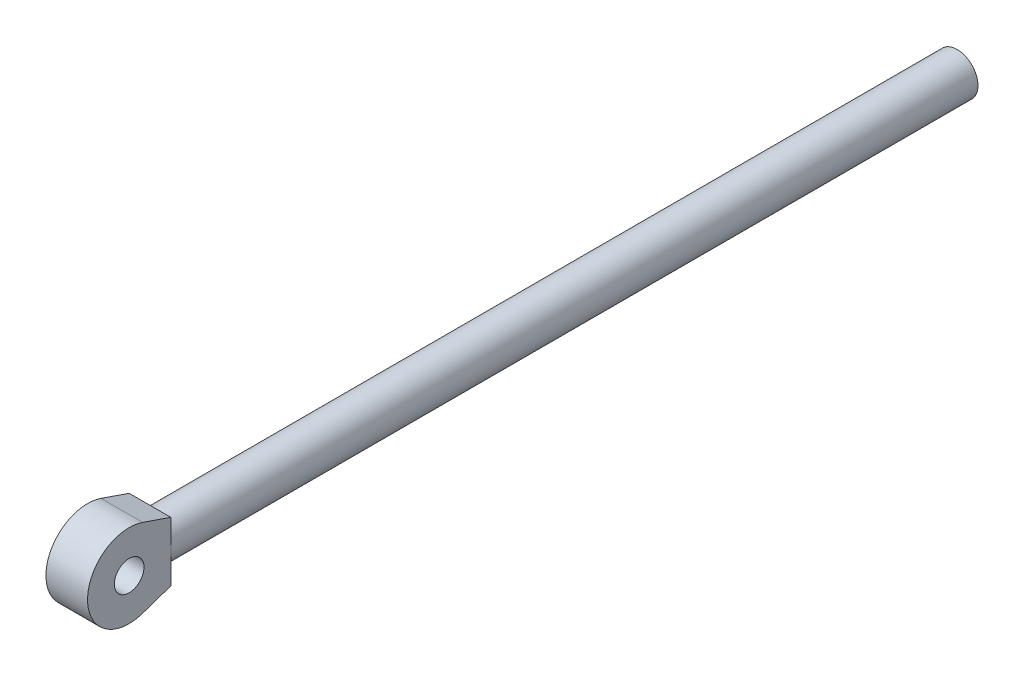
ISO-10303-21;
HEADER;
FILE_DESCRIPTION(('STEP AP214'),'2;1');
FILE_NAME('part.step','',(''),(''),'','','');
FILE_SCHEMA(('AUTOMOTIVE_DESIGN { 1 0 10303 214 1 1 1 1 }'));
ENDSEC;
DATA;
#1=APPLICATION_CONTEXT('core data for automotive mechanical design processes');
#2=APPLICATION_PROTOCOL_DEFINITION('international standard','automotive_design',2000,#1);
#3=PRODUCT_CONTEXT('',#1,'mechanical');
#4=PRODUCT('Part','Part','',(#3));
#5=PRODUCT_RELATED_PRODUCT_CATEGORY('part','',(#4));
#6=PRODUCT_DEFINITION_FORMATION('','',#4);
#7=PRODUCT_DEFINITION_CONTEXT('part definition',#1,'design');
#8=PRODUCT_DEFINITION('design','',#6,#7);
#9=PRODUCT_DEFINITION_SHAPE('','',#8);
#10=(LENGTH_UNIT() NAMED_UNIT(*) SI_UNIT(.MILLI.,.METRE.));
#11=(NAMED_UNIT(*) PLANE_ANGLE_UNIT() SI_UNIT($,.RADIAN.));
#12=(NAMED_UNIT(*) SI_UNIT($,.STERADIAN.) SOLID_ANGLE_UNIT());
#13=UNCERTAINTY_MEASURE_WITH_UNIT(LENGTH_MEASURE(1.E-05),#10,'distance_accuracy_value','');
#14=(GEOMETRIC_REPRESENTATION_CONTEXT(3) GLOBAL_UNCERTAINTY_ASSIGNED_CONTEXT((#13)) GLOBAL_UNIT_ASSIGNED_CONTEXT((#10,
#11,#12)) REPRESENTATION_CONTEXT('',''));
#15=CARTESIAN_POINT('',(0.,0.,0.));
#16=DIRECTION('',(0.,0.,1.));
#17=DIRECTION('',(1.,0.,0.));
#18=AXIS2_PLACEMENT_3D('',#15,#16,#17);
#19=CARTESIAN_POINT('',(0.,0.,679.));
#20=DIRECTION('',(0.,0.,-1.));
#21=DIRECTION('',(-1.,0.,0.));
#22=AXIS2_PLACEMENT_3D('',#19,#20,#21);
#23=CYLINDRICAL_SURFACE('',#22,17.5);
#24=CARTESIAN_POINT('',(0.,0.,679.));
#25=DIRECTION('',(0.,0.,1.));
#26=DIRECTION('',(1.,0.,0.));
#27=AXIS2_PLACEMENT_3D('',#24,#25,#26);
#28=CIRCLE('',#27,17.5);
#29=CARTESIAN_POINT('',(17.5,0.,679.));
#30=VERTEX_POINT('',#29);
#31=CARTESIAN_POINT('',(-17.5,-1.6630703532421E-13,679.));
#32=VERTEX_POINT('',#31);
#33=EDGE_CURVE('E11',#30,#32,#28,.T.);
#34=ORIENTED_EDGE('',*,*,#33,.F.);
#35=EDGE_CURVE('E42',#32,#30,#28,.T.);
#36=ORIENTED_EDGE('',*,*,#35,.F.);
#37=EDGE_LOOP('',(#34,#36));
#38=FACE_BOUND('',#37,.T.);
#39=CARTESIAN_POINT('',(0.,0.,0.));
#40=DIRECTION('',(0.,0.,1.));
#41=DIRECTION('',(1.,0.,0.));
#42=AXIS2_PLACEMENT_3D('',#39,#40,#41);
#43=CIRCLE('',#42,17.5);
#44=CARTESIAN_POINT('',(17.5,0.,0.));
#45=VERTEX_POINT('',#44);
#46=EDGE_CURVE('E36',#45,#45,#43,.T.);
#47=ORIENTED_EDGE('',*,*,#46,.T.);
#48=EDGE_LOOP('',(#47));
#49=FACE_BOUND('',#48,.T.);
#50=ADVANCED_FACE('F33',(#38,#49),#23,.T.);
#51=CARTESIAN_POINT('',(0.,0.,0.));
#52=DIRECTION('',(0.,0.,1.));
#53=DIRECTION('',(1.,0.,0.));
#54=AXIS2_PLACEMENT_3D('',#51,#52,#53);
#55=PLANE('',#54);
#56=ORIENTED_EDGE('',*,*,#46,.F.);
#57=EDGE_LOOP('',(#56));
#58=FACE_BOUND('',#57,.T.);
#59=ADVANCED_FACE('F154',(#58),#55,.F.);
#60=CARTESIAN_POINT('',(17.5,0.,679.));
#61=DIRECTION('',(0.,0.,1.));
#62=DIRECTION('',(1.,0.,0.));
#63=AXIS2_PLACEMENT_3D('',#60,#61,#62);
#64=PLANE('',#63);
#65=DIRECTION('',(0.,1.,0.));
#66=VECTOR('',#65,1.);
#67=CARTESIAN_POINT('',(17.5,0.,679.));
#68=LINE('',#67,#66);
#69=CARTESIAN_POINT('',(17.5,25.,679.));
#70=VERTEX_POINT('',#69);
#71=EDGE_CURVE('E49',#30,#70,#68,.T.);
#72=ORIENTED_EDGE('',*,*,#71,.F.);
#73=ORIENTED_EDGE('',*,*,#33,.T.);
#74=DIRECTION('',(0.,1.,0.));
#75=VECTOR('',#74,1.);
#76=CARTESIAN_POINT('',(-17.5,0.,679.));
#77=LINE('',#76,#75);
#78=CARTESIAN_POINT('',(-17.5,25.,679.));
#79=VERTEX_POINT('',#78);
#80=EDGE_CURVE('E103',#32,#79,#77,.T.);
#81=ORIENTED_EDGE('',*,*,#80,.T.);
#82=DIRECTION('',(-1.,0.,0.));
#83=VECTOR('',#82,1.);
#84=CARTESIAN_POINT('',(17.5,25.,679.));
#85=LINE('',#84,#83);
#86=EDGE_CURVE('E88',#70,#79,#85,.T.);
#87=ORIENTED_EDGE('',*,*,#86,.F.);
#88=EDGE_LOOP('',(#72,#73,#81,#87));
#89=FACE_BOUND('',#88,.T.);
#90=ADVANCED_FACE('F102',(#89),#64,.F.);
#91=CARTESIAN_POINT('',(17.5,25.,679.));
#92=DIRECTION('',(0.,-0.945945945945946,0.324324324324323));
#93=DIRECTION('',(0.,-0.324324324324323,-0.945945945945946));
#94=AXIS2_PLACEMENT_3D('',#91,#92,#93);
#95=PLANE('',#94);
#96=DIRECTION('',(0.,0.324324324324323,0.945945945945946));
#97=VECTOR('',#96,1.);
#98=CARTESIAN_POINT('',(-17.5,25.,679.));
#99=LINE('',#98,#97);
#100=CARTESIAN_POINT('',(-17.5,33.1081081081081,702.648648648649));
#101=VERTEX_POINT('',#100);
#102=EDGE_CURVE('E62',#79,#101,#99,.T.);
#103=ORIENTED_EDGE('',*,*,#102,.T.);
#104=DIRECTION('',(-1.,0.,0.));
#105=VECTOR('',#104,1.);
#106=CARTESIAN_POINT('',(17.5,33.1081081081081,702.648648648649));
#107=LINE('',#106,#105);
#108=CARTESIAN_POINT('',(17.5,33.1081081081081,702.648648648649));
#109=VERTEX_POINT('',#108);
#110=EDGE_CURVE('E91',#109,#101,#107,.T.);
#111=ORIENTED_EDGE('',*,*,#110,.F.);
#112=DIRECTION('',(0.,0.324324324324323,0.945945945945946));
#113=VECTOR('',#112,1.);
#114=CARTESIAN_POINT('',(17.5,25.,679.));
#115=LINE('',#114,#113);
#116=EDGE_CURVE('E86',#70,#109,#115,.T.);
#117=ORIENTED_EDGE('',*,*,#116,.F.);
#118=ORIENTED_EDGE('',*,*,#86,.T.);
#119=EDGE_LOOP('',(#103,#111,#117,#118));
#120=FACE_BOUND('',#119,.T.);
#121=ADVANCED_FACE('F87',(#120),#95,.F.);
#122=CARTESIAN_POINT('',(17.5,0.,714.));
#123=DIRECTION('',(-1.,0.,0.));
#124=DIRECTION('',(0.,0.,1.));
#125=AXIS2_PLACEMENT_3D('',#122,#123,#124);
#126=CYLINDRICAL_SURFACE('',#125,35.);
#127=CARTESIAN_POINT('',(-17.5,0.,714.));
#128=DIRECTION('',(1.,0.,0.));
#129=DIRECTION('',(0.,0.,-1.));
#130=AXIS2_PLACEMENT_3D('',#127,#128,#129);
#131=CIRCLE('',#130,35.);
#132=CARTESIAN_POINT('',(-17.5,-33.1081081081083,702.648648648649));
#133=VERTEX_POINT('',#132);
#134=EDGE_CURVE('E100',#101,#133,#131,.T.);
#135=ORIENTED_EDGE('',*,*,#134,.T.);
#136=DIRECTION('',(-1.,0.,0.));
#137=VECTOR('',#136,1.);
#138=CARTESIAN_POINT('',(17.5,-33.1081081081083,702.648648648649));
#139=LINE('',#138,#137);
#140=CARTESIAN_POINT('',(17.5,-33.1081081081083,702.648648648649));
#141=VERTEX_POINT('',#140);
#142=EDGE_CURVE('E111',#141,#133,#139,.T.);
#143=ORIENTED_EDGE('',*,*,#142,.F.);
#144=CARTESIAN_POINT('',(17.5,0.,714.));
#145=DIRECTION('',(1.,0.,0.));
#146=DIRECTION('',(0.,0.,-1.));
#147=AXIS2_PLACEMENT_3D('',#144,#145,#146);
#148=CIRCLE('',#147,35.);
#149=EDGE_CURVE('E94',#109,#141,#148,.T.);
#150=ORIENTED_EDGE('',*,*,#149,.F.);
#151=ORIENTED_EDGE('',*,*,#110,.T.);
#152=EDGE_LOOP('',(#135,#143,#150,#151));
#153=FACE_BOUND('',#152,.T.);
#154=ADVANCED_FACE('F142',(#153),#126,.T.);
#155=CARTESIAN_POINT('',(17.5,0.,714.));
#156=DIRECTION('',(1.,0.,0.));
#157=DIRECTION('',(0.,0.,-1.));
#158=AXIS2_PLACEMENT_3D('',#155,#156,#157);
#159=PLANE('',#158);
#160=CARTESIAN_POINT('',(17.5,0.,714.));
#161=DIRECTION('',(1.,0.,0.));
#162=DIRECTION('',(0.,0.,-1.));
#163=AXIS2_PLACEMENT_3D('',#160,#161,#162);
#164=CIRCLE('',#163,12.5);
#165=CARTESIAN_POINT('',(17.5,0.,701.5));
#166=VERTEX_POINT('',#165);
#167=EDGE_CURVE('E126',#166,#166,#164,.T.);
#168=ORIENTED_EDGE('',*,*,#167,.F.);
#169=EDGE_LOOP('',(#168));
#170=FACE_BOUND('',#169,.T.);
#171=ORIENTED_EDGE('',*,*,#71,.T.);
#172=ORIENTED_EDGE('',*,*,#116,.T.);
#173=ORIENTED_EDGE('',*,*,#149,.T.);
#174=DIRECTION('',(0.,-0.324324324324324,0.945945945945946));
#175=VECTOR('',#174,1.);
#176=CARTESIAN_POINT('',(17.5,-25.0000000000002,679.));
#177=LINE('',#176,#175);
#178=CARTESIAN_POINT('',(17.5,-25.0000000000002,679.));
#179=VERTEX_POINT('',#178);
#180=EDGE_CURVE('E116',#179,#141,#177,.T.);
#181=ORIENTED_EDGE('',*,*,#180,.F.);
#182=DIRECTION('',(0.,-1.,0.));
#183=VECTOR('',#182,1.);
#184=CARTESIAN_POINT('',(17.5,-1.6630703532421E-13,679.));
#185=LINE('',#184,#183);
#186=EDGE_CURVE('E99',#30,#179,#185,.T.);
#187=ORIENTED_EDGE('',*,*,#186,.F.);
#188=EDGE_LOOP('',(#171,#172,#173,#181,#187));
#189=FACE_BOUND('',#188,.T.);
#190=ADVANCED_FACE('F97',(#170,#189),#159,.T.);
#191=CARTESIAN_POINT('',(-17.5,0.,714.));
#192=DIRECTION('',(1.,0.,0.));
#193=DIRECTION('',(0.,0.,-1.));
#194=AXIS2_PLACEMENT_3D('',#191,#192,#193);
#195=PLANE('',#194);
#196=CARTESIAN_POINT('',(-17.5,0.,714.));
#197=DIRECTION('',(1.,0.,0.));
#198=DIRECTION('',(0.,0.,-1.));
#199=AXIS2_PLACEMENT_3D('',#196,#197,#198);
#200=CIRCLE('',#199,12.5);
#201=CARTESIAN_POINT('',(-17.5,0.,701.5));
#202=VERTEX_POINT('',#201);
#203=EDGE_CURVE('E123',#202,#202,#200,.T.);
#204=ORIENTED_EDGE('',*,*,#203,.T.);
#205=EDGE_LOOP('',(#204));
#206=FACE_BOUND('',#205,.T.);
#207=ORIENTED_EDGE('',*,*,#80,.F.);
#208=DIRECTION('',(0.,-1.,0.));
#209=VECTOR('',#208,1.);
#210=CARTESIAN_POINT('',(-17.5,-1.6630703532421E-13,679.));
#211=LINE('',#210,#209);
#212=CARTESIAN_POINT('',(-17.5,-25.0000000000002,679.));
#213=VERTEX_POINT('',#212);
#214=EDGE_CURVE('E120',#32,#213,#211,.T.);
#215=ORIENTED_EDGE('',*,*,#214,.T.);
#216=DIRECTION('',(0.,-0.324324324324324,0.945945945945946));
#217=VECTOR('',#216,1.);
#218=CARTESIAN_POINT('',(-17.5,-25.0000000000002,679.));
#219=LINE('',#218,#217);
#220=EDGE_CURVE('E117',#213,#133,#219,.T.);
#221=ORIENTED_EDGE('',*,*,#220,.T.);
#222=ORIENTED_EDGE('',*,*,#134,.F.);
#223=ORIENTED_EDGE('',*,*,#102,.F.);
#224=EDGE_LOOP('',(#207,#215,#221,#222,#223));
#225=FACE_BOUND('',#224,.T.);
#226=ADVANCED_FACE('F132',(#206,#225),#195,.F.);
#227=CARTESIAN_POINT('',(17.5,-1.6630703532421E-13,679.));
#228=DIRECTION('',(0.,0.,-1.));
#229=DIRECTION('',(0.,1.,0.));
#230=AXIS2_PLACEMENT_3D('',#227,#228,#229);
#231=PLANE('',#230);
#232=ORIENTED_EDGE('',*,*,#35,.T.);
#233=ORIENTED_EDGE('',*,*,#186,.T.);
#234=DIRECTION('',(-1.,0.,0.));
#235=VECTOR('',#234,1.);
#236=CARTESIAN_POINT('',(17.5,-25.0000000000002,679.));
#237=LINE('',#236,#235);
#238=EDGE_CURVE('E71',#179,#213,#237,.T.);
#239=ORIENTED_EDGE('',*,*,#238,.T.);
#240=ORIENTED_EDGE('',*,*,#214,.F.);
#241=EDGE_LOOP('',(#232,#233,#239,#240));
#242=FACE_BOUND('',#241,.T.);
#243=ADVANCED_FACE('F148',(#242),#231,.T.);
#244=CARTESIAN_POINT('',(17.5,-25.0000000000002,679.));
#245=DIRECTION('',(0.,-0.945945945945946,-0.324324324324324));
#246=DIRECTION('',(0.,0.324324324324324,-0.945945945945946));
#247=AXIS2_PLACEMENT_3D('',#244,#245,#246);
#248=PLANE('',#247);
#249=ORIENTED_EDGE('',*,*,#220,.F.);
#250=ORIENTED_EDGE('',*,*,#238,.F.);
#251=ORIENTED_EDGE('',*,*,#180,.T.);
#252=ORIENTED_EDGE('',*,*,#142,.T.);
#253=EDGE_LOOP('',(#249,#250,#251,#252));
#254=FACE_BOUND('',#253,.T.);
#255=ADVANCED_FACE('F137',(#254),#248,.T.);
#256=CARTESIAN_POINT('',(-17.5,0.,714.));
#257=DIRECTION('',(1.,0.,0.));
#258=DIRECTION('',(0.,0.,-1.));
#259=AXIS2_PLACEMENT_3D('',#256,#257,#258);
#260=CYLINDRICAL_SURFACE('',#259,12.5);
#261=ORIENTED_EDGE('',*,*,#203,.F.);
#262=EDGE_LOOP('',(#261));
#263=FACE_BOUND('',#262,.T.);
#264=ORIENTED_EDGE('',*,*,#167,.T.);
#265=EDGE_LOOP('',(#264));
#266=FACE_BOUND('',#265,.T.);
#267=ADVANCED_FACE('F134',(#263,#266),#260,.F.);
#268=CLOSED_SHELL('',(#50,#59,#90,#121,#154,#190,#226,#243,#255,#267));
#269=MANIFOLD_SOLID_BREP('B2',#268);
#270=ADVANCED_BREP_SHAPE_REPRESENTATION('',(#18,#269),#14);
#271=SHAPE_DEFINITION_REPRESENTATION(#9,#270);
ENDSEC;
END-ISO-10303-21;
